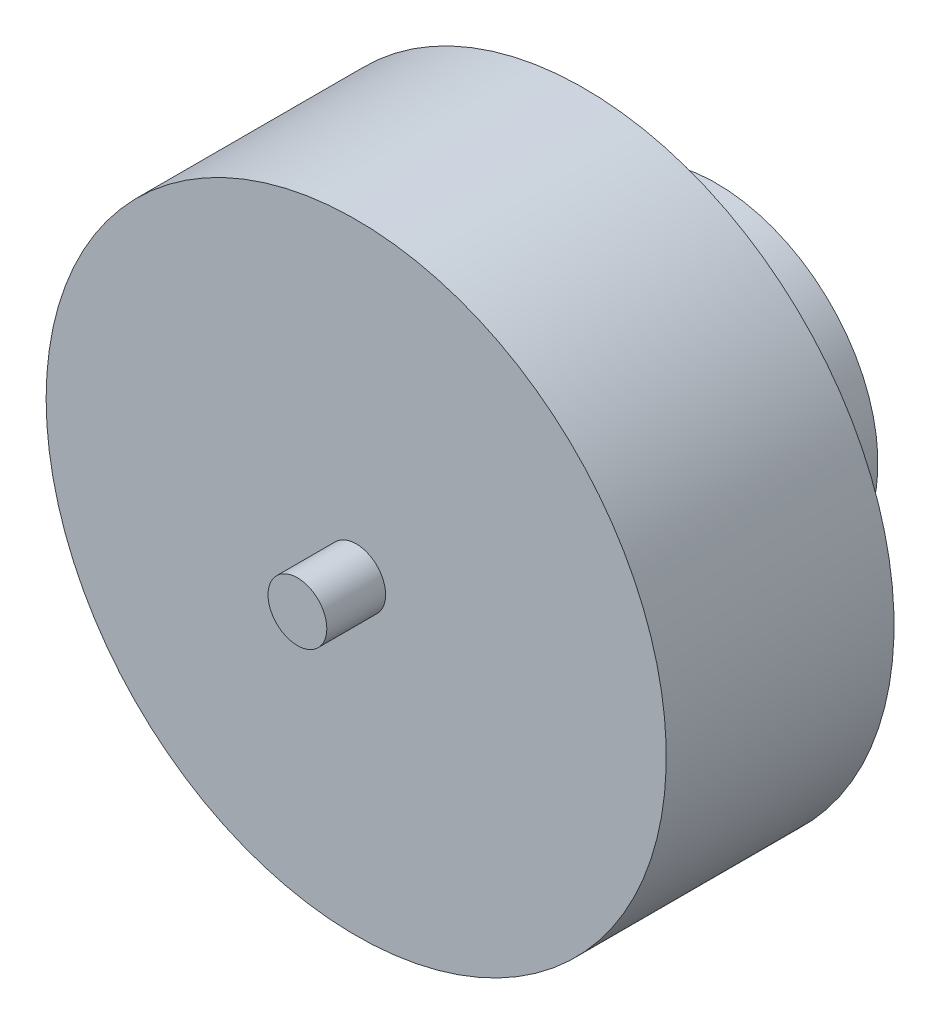
ISO-10303-21;
HEADER;
FILE_DESCRIPTION(('STEP AP214'),'2;1');
FILE_NAME('part.step','',(''),(''),'','','');
FILE_SCHEMA(('AUTOMOTIVE_DESIGN { 1 0 10303 214 1 1 1 1 }'));
ENDSEC;
DATA;
#1=APPLICATION_CONTEXT('core data for automotive mechanical design processes');
#2=APPLICATION_PROTOCOL_DEFINITION('international standard','automotive_design',2000,#1);
#3=PRODUCT_CONTEXT('',#1,'mechanical');
#4=PRODUCT('Part','Part','',(#3));
#5=PRODUCT_RELATED_PRODUCT_CATEGORY('part','',(#4));
#6=PRODUCT_DEFINITION_FORMATION('','',#4);
#7=PRODUCT_DEFINITION_CONTEXT('part definition',#1,'design');
#8=PRODUCT_DEFINITION('design','',#6,#7);
#9=PRODUCT_DEFINITION_SHAPE('','',#8);
#10=(LENGTH_UNIT() NAMED_UNIT(*) SI_UNIT(.MILLI.,.METRE.));
#11=(NAMED_UNIT(*) PLANE_ANGLE_UNIT() SI_UNIT($,.RADIAN.));
#12=(NAMED_UNIT(*) SI_UNIT($,.STERADIAN.) SOLID_ANGLE_UNIT());
#13=UNCERTAINTY_MEASURE_WITH_UNIT(LENGTH_MEASURE(1.E-05),#10,'distance_accuracy_value','');
#14=(GEOMETRIC_REPRESENTATION_CONTEXT(3) GLOBAL_UNCERTAINTY_ASSIGNED_CONTEXT((#13)) GLOBAL_UNIT_ASSIGNED_CONTEXT((#10,
#11,#12)) REPRESENTATION_CONTEXT('',''));
#15=CARTESIAN_POINT('',(0.,0.,0.));
#16=DIRECTION('',(0.,0.,1.));
#17=DIRECTION('',(1.,0.,0.));
#18=AXIS2_PLACEMENT_3D('',#15,#16,#17);
#19=CARTESIAN_POINT('',(0.,0.,0.));
#20=DIRECTION('',(0.,0.,1.));
#21=DIRECTION('',(1.,0.,0.));
#22=AXIS2_PLACEMENT_3D('',#19,#20,#21);
#23=PLANE('',#22);
#24=CARTESIAN_POINT('',(0.,0.,0.));
#25=DIRECTION('',(0.,0.,1.));
#26=DIRECTION('',(1.,0.,0.));
#27=AXIS2_PLACEMENT_3D('',#24,#25,#26);
#28=CIRCLE('',#27,5.5);
#29=CARTESIAN_POINT('',(-5.5,0.,0.));
#30=VERTEX_POINT('',#29);
#31=EDGE_CURVE('E214',#30,#30,#28,.T.);
#32=ORIENTED_EDGE('',*,*,#31,.T.);
#33=EDGE_LOOP('',(#32));
#34=FACE_BOUND('',#33,.T.);
#35=CARTESIAN_POINT('',(0.,0.,0.));
#36=DIRECTION('',(0.,0.,-1.));
#37=DIRECTION('',(1.,0.,0.));
#38=AXIS2_PLACEMENT_3D('',#35,#36,#37);
#39=CIRCLE('',#38,11.180340054099);
#40=CARTESIAN_POINT('',(-11.180340054099,0.,0.));
#41=VERTEX_POINT('',#40);
#42=EDGE_CURVE('E171',#41,#41,#39,.T.);
#43=ORIENTED_EDGE('',*,*,#42,.T.);
#44=EDGE_LOOP('',(#43));
#45=FACE_BOUND('',#44,.T.);
#46=ADVANCED_FACE('F16',(#34,#45),#23,.F.);
#47=CARTESIAN_POINT('',(0.,0.,15.5));
#48=DIRECTION('',(0.,0.,1.));
#49=DIRECTION('',(1.,0.,0.));
#50=AXIS2_PLACEMENT_3D('',#47,#48,#49);
#51=PLANE('',#50);
#52=CARTESIAN_POINT('',(0.,0.,15.5));
#53=DIRECTION('',(0.,0.,-1.));
#54=DIRECTION('',(-1.,0.,0.));
#55=AXIS2_PLACEMENT_3D('',#52,#53,#54);
#56=CIRCLE('',#55,2.);
#57=CARTESIAN_POINT('',(2.,0.,15.5));
#58=VERTEX_POINT('',#57);
#59=EDGE_CURVE('E146',#58,#58,#56,.T.);
#60=ORIENTED_EDGE('',*,*,#59,.T.);
#61=EDGE_LOOP('',(#60));
#62=FACE_BOUND('',#61,.T.);
#63=CARTESIAN_POINT('',(0.,0.,15.5));
#64=DIRECTION('',(0.,0.,1.));
#65=DIRECTION('',(1.,0.,0.));
#66=AXIS2_PLACEMENT_3D('',#63,#64,#65);
#67=CIRCLE('',#66,21.1);
#68=CARTESIAN_POINT('',(-21.1,0.,15.5));
#69=VERTEX_POINT('',#68);
#70=EDGE_CURVE('E27',#69,#69,#67,.T.);
#71=ORIENTED_EDGE('',*,*,#70,.T.);
#72=EDGE_LOOP('',(#71));
#73=FACE_BOUND('',#72,.T.);
#74=ADVANCED_FACE('F267',(#62,#73),#51,.T.);
#75=CARTESIAN_POINT('',(0.,0.,0.));
#76=DIRECTION('',(0.,0.,1.));
#77=DIRECTION('',(1.,0.,0.));
#78=AXIS2_PLACEMENT_3D('',#75,#76,#77);
#79=CYLINDRICAL_SURFACE('',#78,21.1);
#80=ORIENTED_EDGE('',*,*,#70,.F.);
#81=DIRECTION('',(0.,0.,-1.));
#82=VECTOR('',#81,1.);
#83=CARTESIAN_POINT('',(-21.1,0.,0.));
#84=LINE('',#83,#82);
#85=CARTESIAN_POINT('',(-21.1,0.,0.));
#86=VERTEX_POINT('',#85);
#87=EDGE_CURVE('E11',#69,#86,#84,.T.);
#88=ORIENTED_EDGE('',*,*,#87,.T.);
#89=CARTESIAN_POINT('',(0.,0.,0.));
#90=DIRECTION('',(0.,0.,1.));
#91=DIRECTION('',(1.,0.,0.));
#92=AXIS2_PLACEMENT_3D('',#89,#90,#91);
#93=CIRCLE('',#92,21.1);
#94=EDGE_CURVE('E166',#86,#86,#93,.T.);
#95=ORIENTED_EDGE('',*,*,#94,.T.);
#96=ORIENTED_EDGE('',*,*,#87,.F.);
#97=EDGE_LOOP('',(#80,#88,#95,#96));
#98=FACE_BOUND('',#97,.T.);
#99=ADVANCED_FACE('F273',(#98),#79,.T.);
#100=CARTESIAN_POINT('',(0.,0.,19.5));
#101=DIRECTION('',(0.,0.,1.));
#102=DIRECTION('',(1.,0.,0.));
#103=AXIS2_PLACEMENT_3D('',#100,#101,#102);
#104=PLANE('',#103);
#105=CARTESIAN_POINT('',(0.,0.,19.5));
#106=DIRECTION('',(0.,0.,1.));
#107=DIRECTION('',(-1.,0.,0.));
#108=AXIS2_PLACEMENT_3D('',#105,#106,#107);
#109=CIRCLE('',#108,2.);
#110=CARTESIAN_POINT('',(2.,0.,19.5));
#111=VERTEX_POINT('',#110);
#112=EDGE_CURVE('E218',#111,#111,#109,.T.);
#113=ORIENTED_EDGE('',*,*,#112,.T.);
#114=EDGE_LOOP('',(#113));
#115=FACE_BOUND('',#114,.T.);
#116=ADVANCED_FACE('F262',(#115),#104,.T.);
#117=CARTESIAN_POINT('',(0.,0.,15.5));
#118=DIRECTION('',(0.,0.,1.));
#119=DIRECTION('',(-1.,0.,0.));
#120=AXIS2_PLACEMENT_3D('',#117,#118,#119);
#121=CYLINDRICAL_SURFACE('',#120,2.);
#122=ORIENTED_EDGE('',*,*,#112,.F.);
#123=DIRECTION('',(0.,0.,-1.));
#124=VECTOR('',#123,1.);
#125=CARTESIAN_POINT('',(2.,0.,15.5));
#126=LINE('',#125,#124);
#127=EDGE_CURVE('E149',#111,#58,#126,.T.);
#128=ORIENTED_EDGE('',*,*,#127,.T.);
#129=ORIENTED_EDGE('',*,*,#59,.F.);
#130=ORIENTED_EDGE('',*,*,#127,.F.);
#131=EDGE_LOOP('',(#122,#128,#129,#130));
#132=FACE_BOUND('',#131,.T.);
#133=ADVANCED_FACE('F252',(#132),#121,.T.);
#134=CARTESIAN_POINT('',(0.,0.,-9.));
#135=DIRECTION('',(0.,0.,-1.));
#136=DIRECTION('',(0.,-1.,0.));
#137=AXIS2_PLACEMENT_3D('',#134,#135,#136);
#138=PLANE('',#137);
#139=CARTESIAN_POINT('',(0.,9.5,-9.));
#140=DIRECTION('',(0.,0.,1.));
#141=DIRECTION('',(1.,0.,0.));
#142=AXIS2_PLACEMENT_3D('',#139,#140,#141);
#143=CIRCLE('',#142,1.);
#144=CARTESIAN_POINT('',(-1.,9.5,-9.));
#145=VERTEX_POINT('',#144);
#146=EDGE_CURVE('E128',#145,#145,#143,.T.);
#147=ORIENTED_EDGE('',*,*,#146,.T.);
#148=EDGE_LOOP('',(#147));
#149=FACE_BOUND('',#148,.T.);
#150=CARTESIAN_POINT('',(8.,0.,-9.));
#151=DIRECTION('',(0.,0.,1.));
#152=DIRECTION('',(1.,0.,0.));
#153=AXIS2_PLACEMENT_3D('',#150,#151,#152);
#154=CIRCLE('',#153,1.00000001490116);
#155=CARTESIAN_POINT('',(6.99999998509884,0.,-9.));
#156=VERTEX_POINT('',#155);
#157=EDGE_CURVE('E185',#156,#156,#154,.T.);
#158=ORIENTED_EDGE('',*,*,#157,.T.);
#159=EDGE_LOOP('',(#158));
#160=FACE_BOUND('',#159,.T.);
#161=CARTESIAN_POINT('',(-8.,0.,-9.));
#162=DIRECTION('',(0.,0.,1.));
#163=DIRECTION('',(1.,0.,0.));
#164=AXIS2_PLACEMENT_3D('',#161,#162,#163);
#165=CIRCLE('',#164,1.00000001490116);
#166=CARTESIAN_POINT('',(-9.00000001490116,0.,-9.));
#167=VERTEX_POINT('',#166);
#168=EDGE_CURVE('E145',#167,#167,#165,.T.);
#169=ORIENTED_EDGE('',*,*,#168,.T.);
#170=EDGE_LOOP('',(#169));
#171=FACE_BOUND('',#170,.T.);
#172=CARTESIAN_POINT('',(0.,-9.5,-9.));
#173=DIRECTION('',(0.,0.,1.));
#174=DIRECTION('',(1.,0.,0.));
#175=AXIS2_PLACEMENT_3D('',#172,#173,#174);
#176=CIRCLE('',#175,1.);
#177=CARTESIAN_POINT('',(-1.,-9.5,-9.));
#178=VERTEX_POINT('',#177);
#179=EDGE_CURVE('E161',#178,#178,#176,.T.);
#180=ORIENTED_EDGE('',*,*,#179,.T.);
#181=EDGE_LOOP('',(#180));
#182=FACE_BOUND('',#181,.T.);
#183=CARTESIAN_POINT('',(0.,0.,-9.));
#184=DIRECTION('',(0.,0.,-1.));
#185=DIRECTION('',(1.,0.,0.));
#186=AXIS2_PLACEMENT_3D('',#183,#184,#185);
#187=CIRCLE('',#186,11.);
#188=CARTESIAN_POINT('',(-11.,0.,-9.));
#189=VERTEX_POINT('',#188);
#190=EDGE_CURVE('E140',#189,#189,#187,.T.);
#191=ORIENTED_EDGE('',*,*,#190,.T.);
#192=EDGE_LOOP('',(#191));
#193=FACE_BOUND('',#192,.T.);
#194=ADVANCED_FACE('F232',(#149,#160,#171,#182,#193),#138,.T.);
#195=CARTESIAN_POINT('',(0.,0.,0.));
#196=DIRECTION('',(0.,0.,-1.));
#197=DIRECTION('',(1.,0.,0.));
#198=AXIS2_PLACEMENT_3D('',#195,#196,#197);
#199=CYLINDRICAL_SURFACE('',#198,5.5);
#200=CARTESIAN_POINT('',(0.,0.,-6.));
#201=DIRECTION('',(0.,0.,1.));
#202=DIRECTION('',(1.,0.,0.));
#203=AXIS2_PLACEMENT_3D('',#200,#201,#202);
#204=CIRCLE('',#203,5.5);
#205=CARTESIAN_POINT('',(-5.5,0.,-6.));
#206=VERTEX_POINT('',#205);
#207=EDGE_CURVE('E189',#206,#206,#204,.T.);
#208=ORIENTED_EDGE('',*,*,#207,.T.);
#209=DIRECTION('',(0.,0.,1.));
#210=VECTOR('',#209,1.);
#211=CARTESIAN_POINT('',(-5.5,0.,0.));
#212=LINE('',#211,#210);
#213=EDGE_CURVE('E193',#206,#30,#212,.T.);
#214=ORIENTED_EDGE('',*,*,#213,.T.);
#215=ORIENTED_EDGE('',*,*,#31,.F.);
#216=ORIENTED_EDGE('',*,*,#213,.F.);
#217=EDGE_LOOP('',(#208,#214,#215,#216));
#218=FACE_BOUND('',#217,.T.);
#219=ADVANCED_FACE('F240',(#218),#199,.T.);
#220=CARTESIAN_POINT('',(0.,0.,-6.));
#221=DIRECTION('',(0.,0.,-1.));
#222=DIRECTION('',(0.,-1.,0.));
#223=AXIS2_PLACEMENT_3D('',#220,#221,#222);
#224=PLANE('',#223);
#225=ORIENTED_EDGE('',*,*,#207,.F.);
#226=EDGE_LOOP('',(#225));
#227=FACE_BOUND('',#226,.T.);
#228=CARTESIAN_POINT('',(0.,9.5,-6.));
#229=DIRECTION('',(0.,0.,-1.));
#230=DIRECTION('',(1.,0.,0.));
#231=AXIS2_PLACEMENT_3D('',#228,#229,#230);
#232=CIRCLE('',#231,1.);
#233=CARTESIAN_POINT('',(-1.,9.5,-6.));
#234=VERTEX_POINT('',#233);
#235=EDGE_CURVE('E20',#234,#234,#232,.T.);
#236=ORIENTED_EDGE('',*,*,#235,.T.);
#237=EDGE_LOOP('',(#236));
#238=FACE_BOUND('',#237,.T.);
#239=CARTESIAN_POINT('',(8.,0.,-6.));
#240=DIRECTION('',(0.,0.,-1.));
#241=DIRECTION('',(1.,0.,0.));
#242=AXIS2_PLACEMENT_3D('',#239,#240,#241);
#243=CIRCLE('',#242,1.00000001490116);
#244=CARTESIAN_POINT('',(6.99999998509884,0.,-6.));
#245=VERTEX_POINT('',#244);
#246=EDGE_CURVE('E136',#245,#245,#243,.T.);
#247=ORIENTED_EDGE('',*,*,#246,.T.);
#248=EDGE_LOOP('',(#247));
#249=FACE_BOUND('',#248,.T.);
#250=CARTESIAN_POINT('',(-8.,0.,-6.));
#251=DIRECTION('',(0.,0.,-1.));
#252=DIRECTION('',(1.,0.,0.));
#253=AXIS2_PLACEMENT_3D('',#250,#251,#252);
#254=CIRCLE('',#253,1.00000001490116);
#255=CARTESIAN_POINT('',(-9.00000001490116,0.,-6.));
#256=VERTEX_POINT('',#255);
#257=EDGE_CURVE('E144',#256,#256,#254,.T.);
#258=ORIENTED_EDGE('',*,*,#257,.T.);
#259=EDGE_LOOP('',(#258));
#260=FACE_BOUND('',#259,.T.);
#261=CARTESIAN_POINT('',(0.,-9.5,-6.));
#262=DIRECTION('',(0.,0.,-1.));
#263=DIRECTION('',(1.,0.,0.));
#264=AXIS2_PLACEMENT_3D('',#261,#262,#263);
#265=CIRCLE('',#264,1.);
#266=CARTESIAN_POINT('',(-1.,-9.5,-6.));
#267=VERTEX_POINT('',#266);
#268=EDGE_CURVE('E188',#267,#267,#265,.T.);
#269=ORIENTED_EDGE('',*,*,#268,.T.);
#270=EDGE_LOOP('',(#269));
#271=FACE_BOUND('',#270,.T.);
#272=CARTESIAN_POINT('',(0.,0.,-6.));
#273=DIRECTION('',(0.,0.,1.));
#274=DIRECTION('',(1.,0.,0.));
#275=AXIS2_PLACEMENT_3D('',#272,#273,#274);
#276=CIRCLE('',#275,11.);
#277=CARTESIAN_POINT('',(-11.,0.,-6.));
#278=VERTEX_POINT('',#277);
#279=EDGE_CURVE('E120',#278,#278,#276,.T.);
#280=ORIENTED_EDGE('',*,*,#279,.T.);
#281=EDGE_LOOP('',(#280));
#282=FACE_BOUND('',#281,.T.);
#283=ADVANCED_FACE('F115',(#227,#238,#249,#260,#271,#282),#224,.F.);
#284=CARTESIAN_POINT('',(0.,0.,-9.));
#285=DIRECTION('',(0.,0.,1.));
#286=DIRECTION('',(1.,0.,0.));
#287=AXIS2_PLACEMENT_3D('',#284,#285,#286);
#288=CYLINDRICAL_SURFACE('',#287,11.);
#289=ORIENTED_EDGE('',*,*,#279,.F.);
#290=DIRECTION('',(0.,0.,-1.));
#291=VECTOR('',#290,1.);
#292=CARTESIAN_POINT('',(-11.,0.,-9.));
#293=LINE('',#292,#291);
#294=EDGE_CURVE('E106',#278,#189,#293,.T.);
#295=ORIENTED_EDGE('',*,*,#294,.T.);
#296=ORIENTED_EDGE('',*,*,#190,.F.);
#297=ORIENTED_EDGE('',*,*,#294,.F.);
#298=EDGE_LOOP('',(#289,#295,#296,#297));
#299=FACE_BOUND('',#298,.T.);
#300=ADVANCED_FACE('F239',(#299),#288,.T.);
#301=CARTESIAN_POINT('',(0.,9.5,-9.));
#302=DIRECTION('',(0.,0.,1.));
#303=DIRECTION('',(1.,0.,0.));
#304=AXIS2_PLACEMENT_3D('',#301,#302,#303);
#305=CYLINDRICAL_SURFACE('',#304,1.);
#306=ORIENTED_EDGE('',*,*,#146,.F.);
#307=DIRECTION('',(0.,0.,1.));
#308=VECTOR('',#307,1.);
#309=CARTESIAN_POINT('',(-1.,9.5,-9.));
#310=LINE('',#309,#308);
#311=EDGE_CURVE('E121',#145,#234,#310,.T.);
#312=ORIENTED_EDGE('',*,*,#311,.T.);
#313=ORIENTED_EDGE('',*,*,#235,.F.);
#314=ORIENTED_EDGE('',*,*,#311,.F.);
#315=EDGE_LOOP('',(#306,#312,#313,#314));
#316=FACE_BOUND('',#315,.T.);
#317=ADVANCED_FACE('F286',(#316),#305,.F.);
#318=CARTESIAN_POINT('',(8.,0.,-9.));
#319=DIRECTION('',(0.,0.,1.));
#320=DIRECTION('',(1.,0.,0.));
#321=AXIS2_PLACEMENT_3D('',#318,#319,#320);
#322=CYLINDRICAL_SURFACE('',#321,1.00000001490116);
#323=ORIENTED_EDGE('',*,*,#157,.F.);
#324=DIRECTION('',(0.,0.,1.));
#325=VECTOR('',#324,1.);
#326=CARTESIAN_POINT('',(6.99999998509884,0.,-9.));
#327=LINE('',#326,#325);
#328=EDGE_CURVE('E160',#156,#245,#327,.T.);
#329=ORIENTED_EDGE('',*,*,#328,.T.);
#330=ORIENTED_EDGE('',*,*,#246,.F.);
#331=ORIENTED_EDGE('',*,*,#328,.F.);
#332=EDGE_LOOP('',(#323,#329,#330,#331));
#333=FACE_BOUND('',#332,.T.);
#334=ADVANCED_FACE('F18',(#333),#322,.F.);
#335=CARTESIAN_POINT('',(-8.,0.,-9.));
#336=DIRECTION('',(0.,0.,1.));
#337=DIRECTION('',(1.,0.,0.));
#338=AXIS2_PLACEMENT_3D('',#335,#336,#337);
#339=CYLINDRICAL_SURFACE('',#338,1.00000001490116);
#340=ORIENTED_EDGE('',*,*,#168,.F.);
#341=DIRECTION('',(0.,0.,1.));
#342=VECTOR('',#341,1.);
#343=CARTESIAN_POINT('',(-9.00000001490116,0.,-9.));
#344=LINE('',#343,#342);
#345=EDGE_CURVE('E141',#167,#256,#344,.T.);
#346=ORIENTED_EDGE('',*,*,#345,.T.);
#347=ORIENTED_EDGE('',*,*,#257,.F.);
#348=ORIENTED_EDGE('',*,*,#345,.F.);
#349=EDGE_LOOP('',(#340,#346,#347,#348));
#350=FACE_BOUND('',#349,.T.);
#351=ADVANCED_FACE('F283',(#350),#339,.F.);
#352=CARTESIAN_POINT('',(0.,-9.5,-9.));
#353=DIRECTION('',(0.,0.,1.));
#354=DIRECTION('',(1.,0.,0.));
#355=AXIS2_PLACEMENT_3D('',#352,#353,#354);
#356=CYLINDRICAL_SURFACE('',#355,1.);
#357=ORIENTED_EDGE('',*,*,#179,.F.);
#358=DIRECTION('',(0.,0.,1.));
#359=VECTOR('',#358,1.);
#360=CARTESIAN_POINT('',(-1.,-9.5,-9.));
#361=LINE('',#360,#359);
#362=EDGE_CURVE('E165',#178,#267,#361,.T.);
#363=ORIENTED_EDGE('',*,*,#362,.T.);
#364=ORIENTED_EDGE('',*,*,#268,.F.);
#365=ORIENTED_EDGE('',*,*,#362,.F.);
#366=EDGE_LOOP('',(#357,#363,#364,#365));
#367=FACE_BOUND('',#366,.T.);
#368=ADVANCED_FACE('F279',(#367),#356,.F.);
#369=CARTESIAN_POINT('',(0.,0.,0.));
#370=DIRECTION('',(0.,0.,1.));
#371=DIRECTION('',(1.,0.,0.));
#372=AXIS2_PLACEMENT_3D('',#369,#370,#371);
#373=PLANE('',#372);
#374=CARTESIAN_POINT('',(0.,0.,0.));
#375=DIRECTION('',(0.,0.,1.));
#376=DIRECTION('',(1.,0.,0.));
#377=AXIS2_PLACEMENT_3D('',#374,#375,#376);
#378=CIRCLE('',#377,19.1049734592291);
#379=CARTESIAN_POINT('',(-19.1049734592291,0.,0.));
#380=VERTEX_POINT('',#379);
#381=EDGE_CURVE('E153',#380,#380,#378,.T.);
#382=ORIENTED_EDGE('',*,*,#381,.T.);
#383=EDGE_LOOP('',(#382));
#384=FACE_BOUND('',#383,.T.);
#385=ORIENTED_EDGE('',*,*,#94,.F.);
#386=EDGE_LOOP('',(#385));
#387=FACE_BOUND('',#386,.T.);
#388=ADVANCED_FACE('F282',(#384,#387),#373,.F.);
#389=CARTESIAN_POINT('',(0.,0.,12.76));
#390=DIRECTION('',(0.,0.,-1.));
#391=DIRECTION('',(0.,-1.,0.));
#392=AXIS2_PLACEMENT_3D('',#389,#390,#391);
#393=PLANE('',#392);
#394=CARTESIAN_POINT('',(0.,0.,12.76));
#395=DIRECTION('',(0.,0.,-1.));
#396=DIRECTION('',(1.,0.,0.));
#397=AXIS2_PLACEMENT_3D('',#394,#395,#396);
#398=CIRCLE('',#397,11.180340054099);
#399=CARTESIAN_POINT('',(-11.180340054099,0.,12.76));
#400=VERTEX_POINT('',#399);
#401=EDGE_CURVE('E150',#400,#400,#398,.T.);
#402=ORIENTED_EDGE('',*,*,#401,.F.);
#403=EDGE_LOOP('',(#402));
#404=FACE_BOUND('',#403,.T.);
#405=CARTESIAN_POINT('',(0.,0.,12.76));
#406=DIRECTION('',(0.,0.,1.));
#407=DIRECTION('',(1.,0.,0.));
#408=AXIS2_PLACEMENT_3D('',#405,#406,#407);
#409=CIRCLE('',#408,19.1049734592291);
#410=CARTESIAN_POINT('',(-19.1049734592291,0.,12.76));
#411=VERTEX_POINT('',#410);
#412=EDGE_CURVE('E170',#411,#411,#409,.T.);
#413=ORIENTED_EDGE('',*,*,#412,.F.);
#414=EDGE_LOOP('',(#413));
#415=FACE_BOUND('',#414,.T.);
#416=ADVANCED_FACE('F292',(#404,#415),#393,.T.);
#417=CARTESIAN_POINT('',(0.,0.,0.));
#418=DIRECTION('',(0.,0.,1.));
#419=DIRECTION('',(1.,0.,0.));
#420=AXIS2_PLACEMENT_3D('',#417,#418,#419);
#421=CYLINDRICAL_SURFACE('',#420,19.1049734592291);
#422=ORIENTED_EDGE('',*,*,#381,.F.);
#423=DIRECTION('',(0.,0.,1.));
#424=VECTOR('',#423,1.);
#425=CARTESIAN_POINT('',(-19.1049734592291,0.,0.));
#426=LINE('',#425,#424);
#427=EDGE_CURVE('E167',#380,#411,#426,.T.);
#428=ORIENTED_EDGE('',*,*,#427,.T.);
#429=ORIENTED_EDGE('',*,*,#412,.T.);
#430=ORIENTED_EDGE('',*,*,#427,.F.);
#431=EDGE_LOOP('',(#422,#428,#429,#430));
#432=FACE_BOUND('',#431,.T.);
#433=ADVANCED_FACE('F294',(#432),#421,.F.);
#434=CARTESIAN_POINT('',(0.,0.,0.));
#435=DIRECTION('',(0.,0.,1.));
#436=DIRECTION('',(1.,0.,0.));
#437=AXIS2_PLACEMENT_3D('',#434,#435,#436);
#438=CYLINDRICAL_SURFACE('',#437,11.180340054099);
#439=ORIENTED_EDGE('',*,*,#42,.F.);
#440=DIRECTION('',(0.,0.,1.));
#441=VECTOR('',#440,1.);
#442=CARTESIAN_POINT('',(-11.180340054099,0.,0.));
#443=LINE('',#442,#441);
#444=EDGE_CURVE('E154',#41,#400,#443,.T.);
#445=ORIENTED_EDGE('',*,*,#444,.T.);
#446=ORIENTED_EDGE('',*,*,#401,.T.);
#447=ORIENTED_EDGE('',*,*,#444,.F.);
#448=EDGE_LOOP('',(#439,#445,#446,#447));
#449=FACE_BOUND('',#448,.T.);
#450=ADVANCED_FACE('F278',(#449),#438,.T.);
#451=CLOSED_SHELL('',(#46,#74,#99,#116,#133,#194,#219,#283,#300,#317,#334,#351,#368,#388,#416,
#433,#450));
#452=MANIFOLD_SOLID_BREP('B1',#451);
#453=ADVANCED_BREP_SHAPE_REPRESENTATION('',(#18,#452),#14);
#454=SHAPE_DEFINITION_REPRESENTATION(#9,#453);
ENDSEC;
END-ISO-10303-21;
